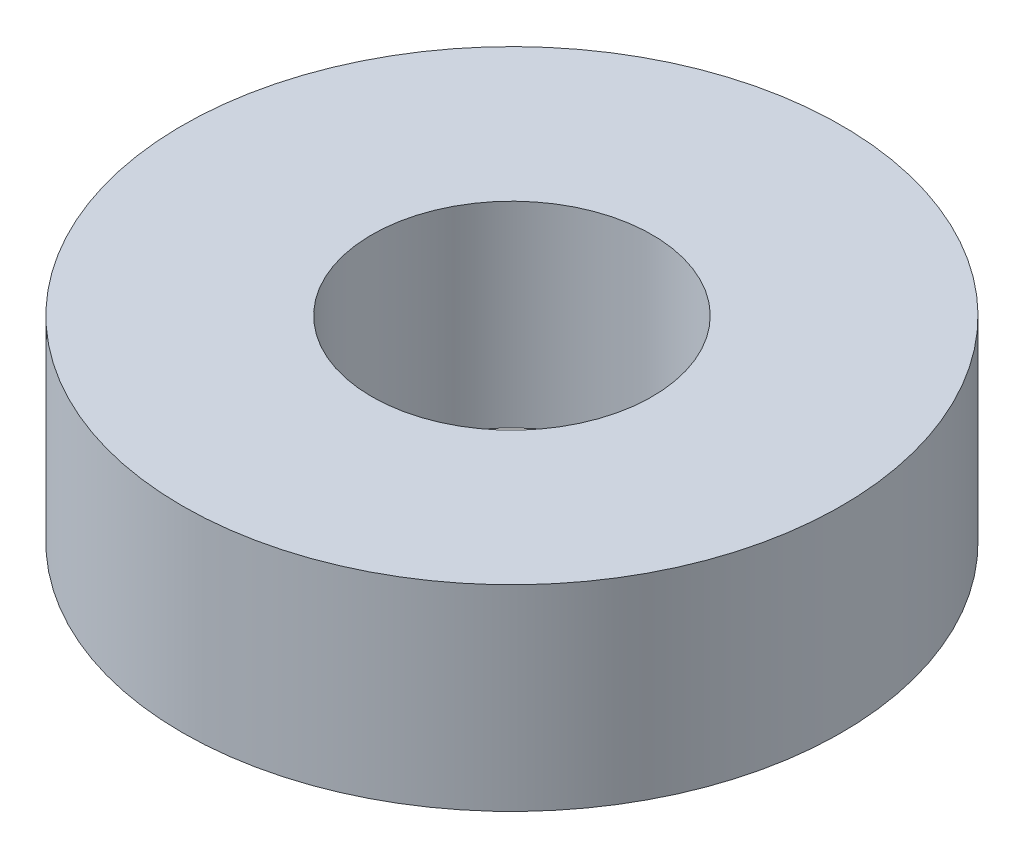
ISO-10303-21;
HEADER;
FILE_DESCRIPTION(('STEP AP214'),'2;1');
FILE_NAME('part.step','',(''),(''),'','','');
FILE_SCHEMA(('AUTOMOTIVE_DESIGN { 1 0 10303 214 1 1 1 1 }'));
ENDSEC;
DATA;
#1=APPLICATION_CONTEXT('core data for automotive mechanical design processes');
#2=APPLICATION_PROTOCOL_DEFINITION('international standard','automotive_design',2000,#1);
#3=PRODUCT_CONTEXT('',#1,'mechanical');
#4=PRODUCT('Part','Part','',(#3));
#5=PRODUCT_RELATED_PRODUCT_CATEGORY('part','',(#4));
#6=PRODUCT_DEFINITION_FORMATION('','',#4);
#7=PRODUCT_DEFINITION_CONTEXT('part definition',#1,'design');
#8=PRODUCT_DEFINITION('design','',#6,#7);
#9=PRODUCT_DEFINITION_SHAPE('','',#8);
#10=(LENGTH_UNIT() NAMED_UNIT(*) SI_UNIT(.MILLI.,.METRE.));
#11=(NAMED_UNIT(*) PLANE_ANGLE_UNIT() SI_UNIT($,.RADIAN.));
#12=(NAMED_UNIT(*) SI_UNIT($,.STERADIAN.) SOLID_ANGLE_UNIT());
#13=UNCERTAINTY_MEASURE_WITH_UNIT(LENGTH_MEASURE(1.E-05),#10,'distance_accuracy_value','');
#14=(GEOMETRIC_REPRESENTATION_CONTEXT(3) GLOBAL_UNCERTAINTY_ASSIGNED_CONTEXT((#13)) GLOBAL_UNIT_ASSIGNED_CONTEXT((#10,
#11,#12)) REPRESENTATION_CONTEXT('',''));
#15=CARTESIAN_POINT('',(0.,0.,0.));
#16=DIRECTION('',(0.,0.,1.));
#17=DIRECTION('',(1.,0.,0.));
#18=AXIS2_PLACEMENT_3D('',#15,#16,#17);
#19=CARTESIAN_POINT('',(0.,14.,0.));
#20=DIRECTION('',(0.,1.,0.));
#21=DIRECTION('',(0.,0.,1.));
#22=AXIS2_PLACEMENT_3D('',#19,#20,#21);
#23=PLANE('',#22);
#24=CARTESIAN_POINT('',(0.,14.,0.));
#25=DIRECTION('',(0.,1.,0.));
#26=DIRECTION('',(0.,0.,1.));
#27=AXIS2_PLACEMENT_3D('',#24,#25,#26);
#28=CIRCLE('',#27,23.5);
#29=CARTESIAN_POINT('',(0.,14.,23.5));
#30=VERTEX_POINT('',#29);
#31=EDGE_CURVE('E11',#30,#30,#28,.T.);
#32=ORIENTED_EDGE('',*,*,#31,.T.);
#33=EDGE_LOOP('',(#32));
#34=FACE_BOUND('',#33,.T.);
#35=CARTESIAN_POINT('',(0.,14.,0.));
#36=DIRECTION('',(0.,1.,0.));
#37=DIRECTION('',(0.,0.,1.));
#38=AXIS2_PLACEMENT_3D('',#35,#36,#37);
#39=CIRCLE('',#38,10.);
#40=CARTESIAN_POINT('',(0.,14.,10.));
#41=VERTEX_POINT('',#40);
#42=EDGE_CURVE('E51',#41,#41,#39,.T.);
#43=ORIENTED_EDGE('',*,*,#42,.F.);
#44=EDGE_LOOP('',(#43));
#45=FACE_BOUND('',#44,.T.);
#46=ADVANCED_FACE('F40',(#34,#45),#23,.T.);
#47=CARTESIAN_POINT('',(0.,0.,0.));
#48=DIRECTION('',(0.,1.,0.));
#49=DIRECTION('',(0.,0.,1.));
#50=AXIS2_PLACEMENT_3D('',#47,#48,#49);
#51=PLANE('',#50);
#52=CARTESIAN_POINT('',(0.,0.,0.));
#53=DIRECTION('',(0.,1.,0.));
#54=DIRECTION('',(0.,0.,1.));
#55=AXIS2_PLACEMENT_3D('',#52,#53,#54);
#56=CIRCLE('',#55,23.5);
#57=CARTESIAN_POINT('',(0.,0.,23.5));
#58=VERTEX_POINT('',#57);
#59=EDGE_CURVE('E44',#58,#58,#56,.T.);
#60=ORIENTED_EDGE('',*,*,#59,.F.);
#61=EDGE_LOOP('',(#60));
#62=FACE_BOUND('',#61,.T.);
#63=CARTESIAN_POINT('',(0.,0.,0.));
#64=DIRECTION('',(0.,1.,0.));
#65=DIRECTION('',(0.,0.,1.));
#66=AXIS2_PLACEMENT_3D('',#63,#64,#65);
#67=CIRCLE('',#66,10.);
#68=CARTESIAN_POINT('',(0.,0.,10.));
#69=VERTEX_POINT('',#68);
#70=EDGE_CURVE('E53',#69,#69,#67,.T.);
#71=ORIENTED_EDGE('',*,*,#70,.T.);
#72=EDGE_LOOP('',(#71));
#73=FACE_BOUND('',#72,.T.);
#74=ADVANCED_FACE('F63',(#62,#73),#51,.F.);
#75=CARTESIAN_POINT('',(0.,14.,0.));
#76=DIRECTION('',(0.,-1.,0.));
#77=DIRECTION('',(0.,0.,-1.));
#78=AXIS2_PLACEMENT_3D('',#75,#76,#77);
#79=CYLINDRICAL_SURFACE('',#78,23.5);
#80=ORIENTED_EDGE('',*,*,#31,.F.);
#81=EDGE_LOOP('',(#80));
#82=FACE_BOUND('',#81,.T.);
#83=ORIENTED_EDGE('',*,*,#59,.T.);
#84=EDGE_LOOP('',(#83));
#85=FACE_BOUND('',#84,.T.);
#86=ADVANCED_FACE('F42',(#82,#85),#79,.T.);
#87=CARTESIAN_POINT('',(0.,14.,0.));
#88=DIRECTION('',(0.,-1.,0.));
#89=DIRECTION('',(0.,0.,-1.));
#90=AXIS2_PLACEMENT_3D('',#87,#88,#89);
#91=CYLINDRICAL_SURFACE('',#90,10.);
#92=ORIENTED_EDGE('',*,*,#42,.T.);
#93=EDGE_LOOP('',(#92));
#94=FACE_BOUND('',#93,.T.);
#95=ORIENTED_EDGE('',*,*,#70,.F.);
#96=EDGE_LOOP('',(#95));
#97=FACE_BOUND('',#96,.T.);
#98=ADVANCED_FACE('F59',(#94,#97),#91,.F.);
#99=CLOSED_SHELL('',(#46,#74,#86,#98));
#100=MANIFOLD_SOLID_BREP('B2',#99);
#101=ADVANCED_BREP_SHAPE_REPRESENTATION('',(#18,#100),#14);
#102=SHAPE_DEFINITION_REPRESENTATION(#9,#101);
ENDSEC;
END-ISO-10303-21;
